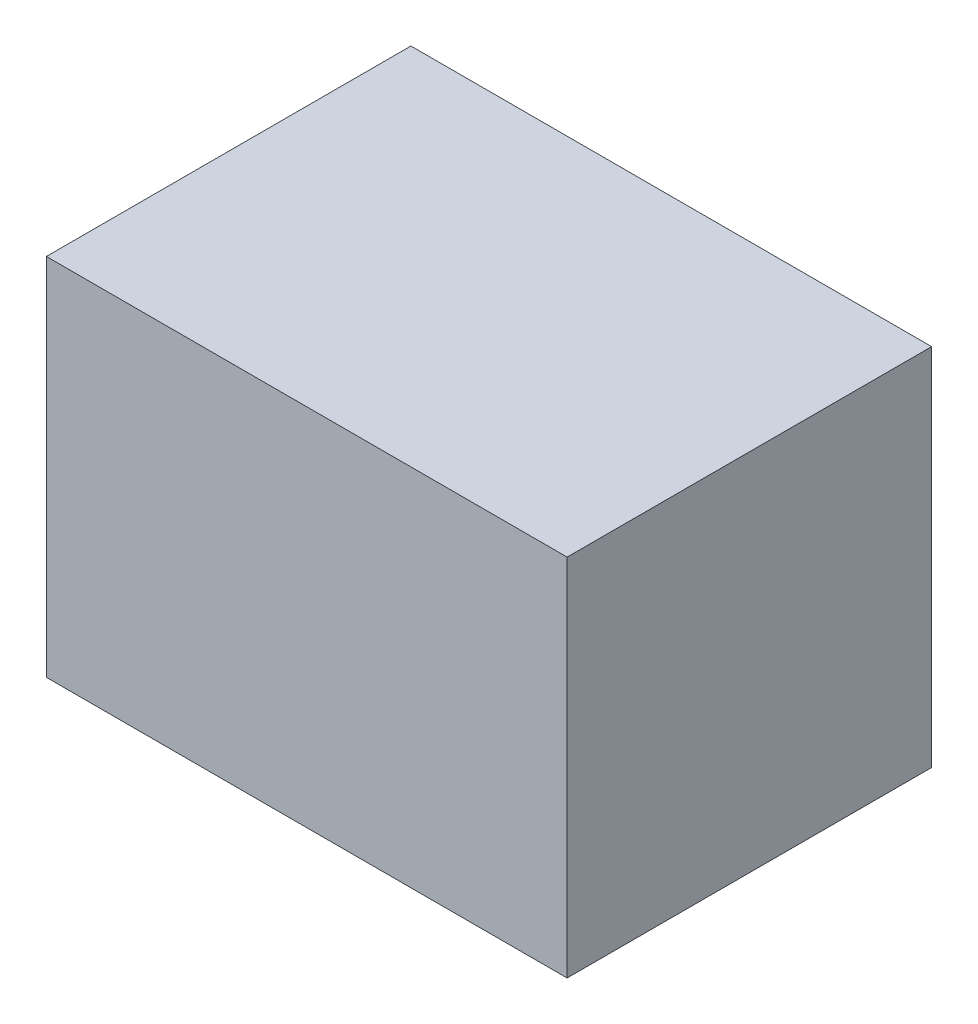
ISO-10303-21;
HEADER;
FILE_DESCRIPTION(('STEP AP214'),'2;1');
FILE_NAME('part.step','',(''),(''),'','','');
FILE_SCHEMA(('AUTOMOTIVE_DESIGN { 1 0 10303 214 1 1 1 1 }'));
ENDSEC;
DATA;
#1=APPLICATION_CONTEXT('core data for automotive mechanical design processes');
#2=APPLICATION_PROTOCOL_DEFINITION('international standard','automotive_design',2000,#1);
#3=PRODUCT_CONTEXT('',#1,'mechanical');
#4=PRODUCT('Part','Part','',(#3));
#5=PRODUCT_RELATED_PRODUCT_CATEGORY('part','',(#4));
#6=PRODUCT_DEFINITION_FORMATION('','',#4);
#7=PRODUCT_DEFINITION_CONTEXT('part definition',#1,'design');
#8=PRODUCT_DEFINITION('design','',#6,#7);
#9=PRODUCT_DEFINITION_SHAPE('','',#8);
#10=(LENGTH_UNIT() NAMED_UNIT(*) SI_UNIT(.MILLI.,.METRE.));
#11=(NAMED_UNIT(*) PLANE_ANGLE_UNIT() SI_UNIT($,.RADIAN.));
#12=(NAMED_UNIT(*) SI_UNIT($,.STERADIAN.) SOLID_ANGLE_UNIT());
#13=UNCERTAINTY_MEASURE_WITH_UNIT(LENGTH_MEASURE(1.E-05),#10,'distance_accuracy_value','');
#14=(GEOMETRIC_REPRESENTATION_CONTEXT(3) GLOBAL_UNCERTAINTY_ASSIGNED_CONTEXT((#13)) GLOBAL_UNIT_ASSIGNED_CONTEXT((#10,
#11,#12)) REPRESENTATION_CONTEXT('',''));
#15=CARTESIAN_POINT('',(0.,0.,0.));
#16=DIRECTION('',(0.,0.,1.));
#17=DIRECTION('',(1.,0.,0.));
#18=AXIS2_PLACEMENT_3D('',#15,#16,#17);
#19=CARTESIAN_POINT('',(-30.48,0.,0.));
#20=DIRECTION('',(0.,-1.,0.));
#21=DIRECTION('',(0.,0.,-1.));
#22=AXIS2_PLACEMENT_3D('',#19,#20,#21);
#23=PLANE('',#22);
#24=DIRECTION('',(1.,0.,0.));
#25=VECTOR('',#24,1.);
#26=CARTESIAN_POINT('',(-30.48,0.,-1.1));
#27=LINE('',#26,#25);
#28=CARTESIAN_POINT('',(-15.49,0.,-1.1));
#29=VERTEX_POINT('',#28);
#30=CARTESIAN_POINT('',(-14.99,0.,-1.1));
#31=VERTEX_POINT('',#30);
#32=EDGE_CURVE('E88',#29,#31,#27,.T.);
#33=ORIENTED_EDGE('',*,*,#32,.F.);
#34=DIRECTION('',(0.,0.,1.));
#35=VECTOR('',#34,1.);
#36=CARTESIAN_POINT('',(-15.49,0.,0.));
#37=LINE('',#36,#35);
#38=CARTESIAN_POINT('',(-15.49,0.,-0.75));
#39=VERTEX_POINT('',#38);
#40=EDGE_CURVE('E27',#29,#39,#37,.T.);
#41=ORIENTED_EDGE('',*,*,#40,.T.);
#42=DIRECTION('',(1.,0.,0.));
#43=VECTOR('',#42,1.);
#44=CARTESIAN_POINT('',(-30.48,0.,-0.75));
#45=LINE('',#44,#43);
#46=CARTESIAN_POINT('',(-14.99,0.,-0.75));
#47=VERTEX_POINT('',#46);
#48=EDGE_CURVE('E78',#39,#47,#45,.T.);
#49=ORIENTED_EDGE('',*,*,#48,.T.);
#50=DIRECTION('',(0.,0.,1.));
#51=VECTOR('',#50,1.);
#52=CARTESIAN_POINT('',(-14.99,0.,0.));
#53=LINE('',#52,#51);
#54=EDGE_CURVE('E97',#31,#47,#53,.T.);
#55=ORIENTED_EDGE('',*,*,#54,.F.);
#56=EDGE_LOOP('',(#33,#41,#49,#55));
#57=FACE_BOUND('',#56,.T.);
#58=ADVANCED_FACE('F17',(#57),#23,.F.);
#59=CARTESIAN_POINT('',(-30.48,-0.35,0.));
#60=DIRECTION('',(0.,-1.,0.));
#61=DIRECTION('',(0.,0.,-1.));
#62=AXIS2_PLACEMENT_3D('',#59,#60,#61);
#63=PLANE('',#62);
#64=DIRECTION('',(1.,0.,0.));
#65=VECTOR('',#64,1.);
#66=CARTESIAN_POINT('',(-30.48,-0.35,-1.1));
#67=LINE('',#66,#65);
#68=CARTESIAN_POINT('',(-15.49,-0.35,-1.1));
#69=VERTEX_POINT('',#68);
#70=CARTESIAN_POINT('',(-14.99,-0.35,-1.1));
#71=VERTEX_POINT('',#70);
#72=EDGE_CURVE('E81',#69,#71,#67,.T.);
#73=ORIENTED_EDGE('',*,*,#72,.T.);
#74=DIRECTION('',(0.,0.,1.));
#75=VECTOR('',#74,1.);
#76=CARTESIAN_POINT('',(-14.99,-0.35,0.));
#77=LINE('',#76,#75);
#78=CARTESIAN_POINT('',(-14.99,-0.35,-0.75));
#79=VERTEX_POINT('',#78);
#80=EDGE_CURVE('E67',#71,#79,#77,.T.);
#81=ORIENTED_EDGE('',*,*,#80,.T.);
#82=DIRECTION('',(1.,0.,0.));
#83=VECTOR('',#82,1.);
#84=CARTESIAN_POINT('',(-30.48,-0.35,-0.75));
#85=LINE('',#84,#83);
#86=CARTESIAN_POINT('',(-15.49,-0.35,-0.75));
#87=VERTEX_POINT('',#86);
#88=EDGE_CURVE('E104',#87,#79,#85,.T.);
#89=ORIENTED_EDGE('',*,*,#88,.F.);
#90=DIRECTION('',(0.,0.,1.));
#91=VECTOR('',#90,1.);
#92=CARTESIAN_POINT('',(-15.49,-0.35,0.));
#93=LINE('',#92,#91);
#94=EDGE_CURVE('E11',#69,#87,#93,.T.);
#95=ORIENTED_EDGE('',*,*,#94,.F.);
#96=EDGE_LOOP('',(#73,#81,#89,#95));
#97=FACE_BOUND('',#96,.T.);
#98=ADVANCED_FACE('F82',(#97),#63,.T.);
#99=CARTESIAN_POINT('',(-15.49,-0.35,0.));
#100=DIRECTION('',(-1.,0.,0.));
#101=DIRECTION('',(0.,0.,1.));
#102=AXIS2_PLACEMENT_3D('',#99,#100,#101);
#103=PLANE('',#102);
#104=ORIENTED_EDGE('',*,*,#40,.F.);
#105=DIRECTION('',(0.,1.,0.));
#106=VECTOR('',#105,1.);
#107=CARTESIAN_POINT('',(-15.49,-0.35,-1.1));
#108=LINE('',#107,#106);
#109=EDGE_CURVE('E86',#69,#29,#108,.T.);
#110=ORIENTED_EDGE('',*,*,#109,.F.);
#111=ORIENTED_EDGE('',*,*,#94,.T.);
#112=DIRECTION('',(0.,1.,0.));
#113=VECTOR('',#112,1.);
#114=CARTESIAN_POINT('',(-15.49,-0.35,-0.75));
#115=LINE('',#114,#113);
#116=EDGE_CURVE('E101',#87,#39,#115,.T.);
#117=ORIENTED_EDGE('',*,*,#116,.T.);
#118=EDGE_LOOP('',(#104,#110,#111,#117));
#119=FACE_BOUND('',#118,.T.);
#120=ADVANCED_FACE('F118',(#119),#103,.T.);
#121=CARTESIAN_POINT('',(-30.48,-0.35,-0.75));
#122=DIRECTION('',(0.,0.,1.));
#123=DIRECTION('',(1.,0.,0.));
#124=AXIS2_PLACEMENT_3D('',#121,#122,#123);
#125=PLANE('',#124);
#126=ORIENTED_EDGE('',*,*,#48,.F.);
#127=ORIENTED_EDGE('',*,*,#116,.F.);
#128=ORIENTED_EDGE('',*,*,#88,.T.);
#129=DIRECTION('',(0.,1.,0.));
#130=VECTOR('',#129,1.);
#131=CARTESIAN_POINT('',(-14.99,-0.35,-0.75));
#132=LINE('',#131,#130);
#133=EDGE_CURVE('E75',#79,#47,#132,.T.);
#134=ORIENTED_EDGE('',*,*,#133,.T.);
#135=EDGE_LOOP('',(#126,#127,#128,#134));
#136=FACE_BOUND('',#135,.T.);
#137=ADVANCED_FACE('F120',(#136),#125,.T.);
#138=CARTESIAN_POINT('',(-14.99,-0.35,0.));
#139=DIRECTION('',(-1.,0.,0.));
#140=DIRECTION('',(0.,0.,1.));
#141=AXIS2_PLACEMENT_3D('',#138,#139,#140);
#142=PLANE('',#141);
#143=ORIENTED_EDGE('',*,*,#54,.T.);
#144=ORIENTED_EDGE('',*,*,#133,.F.);
#145=ORIENTED_EDGE('',*,*,#80,.F.);
#146=DIRECTION('',(0.,1.,0.));
#147=VECTOR('',#146,1.);
#148=CARTESIAN_POINT('',(-14.99,-0.35,-1.1));
#149=LINE('',#148,#147);
#150=EDGE_CURVE('E72',#71,#31,#149,.T.);
#151=ORIENTED_EDGE('',*,*,#150,.T.);
#152=EDGE_LOOP('',(#143,#144,#145,#151));
#153=FACE_BOUND('',#152,.T.);
#154=ADVANCED_FACE('F70',(#153),#142,.F.);
#155=CARTESIAN_POINT('',(-30.48,-0.35,-1.1));
#156=DIRECTION('',(0.,0.,1.));
#157=DIRECTION('',(1.,0.,0.));
#158=AXIS2_PLACEMENT_3D('',#155,#156,#157);
#159=PLANE('',#158);
#160=ORIENTED_EDGE('',*,*,#32,.T.);
#161=ORIENTED_EDGE('',*,*,#150,.F.);
#162=ORIENTED_EDGE('',*,*,#72,.F.);
#163=ORIENTED_EDGE('',*,*,#109,.T.);
#164=EDGE_LOOP('',(#160,#161,#162,#163));
#165=FACE_BOUND('',#164,.T.);
#166=ADVANCED_FACE('F19',(#165),#159,.F.);
#167=CLOSED_SHELL('',(#58,#98,#120,#137,#154,#166));
#168=MANIFOLD_SOLID_BREP('B1',#167);
#169=ADVANCED_BREP_SHAPE_REPRESENTATION('',(#18,#168),#14);
#170=SHAPE_DEFINITION_REPRESENTATION(#9,#169);
ENDSEC;
END-ISO-10303-21;
